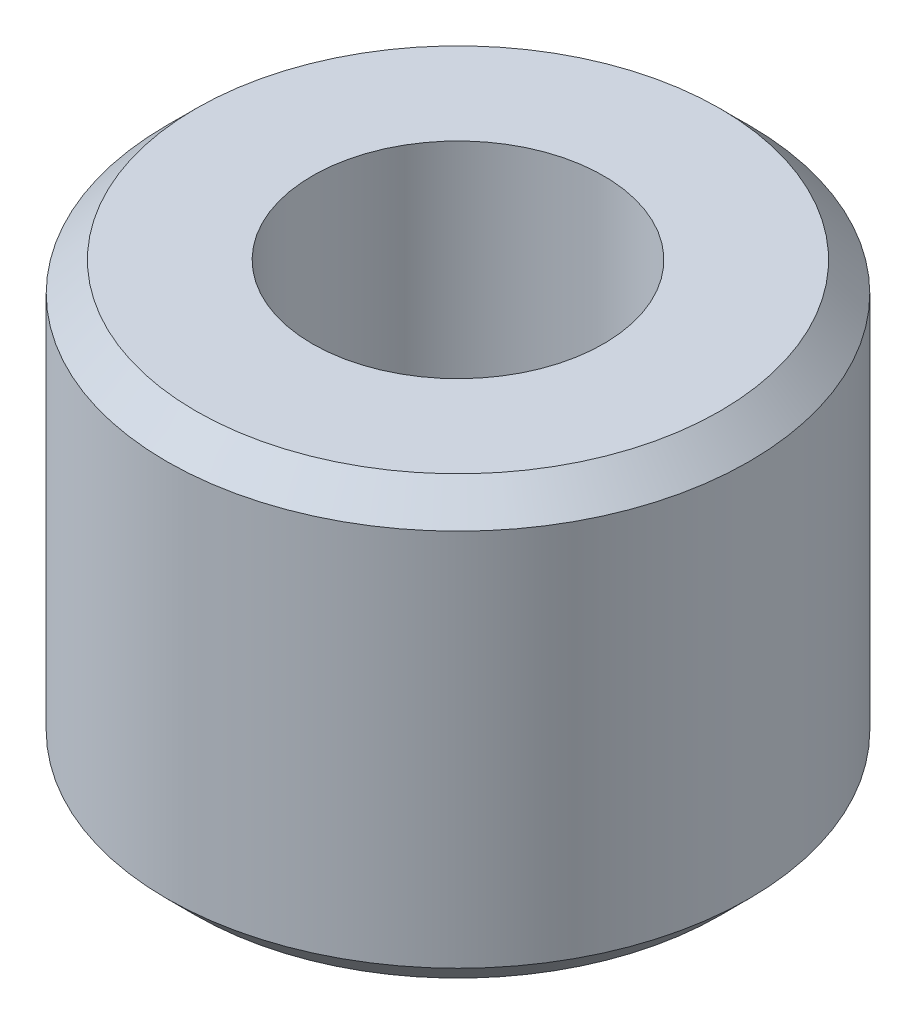
ISO-10303-21;
HEADER;
FILE_DESCRIPTION(('STEP AP214'),'2;1');
FILE_NAME('part.step','',(''),(''),'','','');
FILE_SCHEMA(('AUTOMOTIVE_DESIGN { 1 0 10303 214 1 1 1 1 }'));
ENDSEC;
DATA;
#1=APPLICATION_CONTEXT('core data for automotive mechanical design processes');
#2=APPLICATION_PROTOCOL_DEFINITION('international standard','automotive_design',2000,#1);
#3=PRODUCT_CONTEXT('',#1,'mechanical');
#4=PRODUCT('Part','Part','',(#3));
#5=PRODUCT_RELATED_PRODUCT_CATEGORY('part','',(#4));
#6=PRODUCT_DEFINITION_FORMATION('','',#4);
#7=PRODUCT_DEFINITION_CONTEXT('part definition',#1,'design');
#8=PRODUCT_DEFINITION('design','',#6,#7);
#9=PRODUCT_DEFINITION_SHAPE('','',#8);
#10=(LENGTH_UNIT() NAMED_UNIT(*) SI_UNIT(.MILLI.,.METRE.));
#11=(NAMED_UNIT(*) PLANE_ANGLE_UNIT() SI_UNIT($,.RADIAN.));
#12=(NAMED_UNIT(*) SI_UNIT($,.STERADIAN.) SOLID_ANGLE_UNIT());
#13=UNCERTAINTY_MEASURE_WITH_UNIT(LENGTH_MEASURE(1.E-05),#10,'distance_accuracy_value','');
#14=(GEOMETRIC_REPRESENTATION_CONTEXT(3) GLOBAL_UNCERTAINTY_ASSIGNED_CONTEXT((#13)) GLOBAL_UNIT_ASSIGNED_CONTEXT((#10,
#11,#12)) REPRESENTATION_CONTEXT('',''));
#15=CARTESIAN_POINT('',(0.,0.,0.));
#16=DIRECTION('',(0.,0.,1.));
#17=DIRECTION('',(1.,0.,0.));
#18=AXIS2_PLACEMENT_3D('',#15,#16,#17);
#19=CARTESIAN_POINT('',(0.,15.,0.));
#20=DIRECTION('',(0.,1.,0.));
#21=DIRECTION('',(0.,0.,1.));
#22=AXIS2_PLACEMENT_3D('',#19,#20,#21);
#23=PLANE('',#22);
#24=CARTESIAN_POINT('',(0.,15.,0.));
#25=DIRECTION('',(0.,1.,0.));
#26=DIRECTION('',(0.,0.,1.));
#27=AXIS2_PLACEMENT_3D('',#24,#25,#26);
#28=CIRCLE('',#27,9.00000000000001);
#29=CARTESIAN_POINT('',(0.,15.,9.00000000000001));
#30=VERTEX_POINT('',#29);
#31=EDGE_CURVE('E10',#30,#30,#28,.T.);
#32=ORIENTED_EDGE('',*,*,#31,.T.);
#33=EDGE_LOOP('',(#32));
#34=FACE_BOUND('',#33,.T.);
#35=CARTESIAN_POINT('',(0.,15.,0.));
#36=DIRECTION('',(0.,1.,0.));
#37=DIRECTION('',(0.,0.,1.));
#38=AXIS2_PLACEMENT_3D('',#35,#36,#37);
#39=CIRCLE('',#38,5.);
#40=CARTESIAN_POINT('',(0.,15.,5.));
#41=VERTEX_POINT('',#40);
#42=EDGE_CURVE('E64',#41,#41,#39,.T.);
#43=ORIENTED_EDGE('',*,*,#42,.F.);
#44=EDGE_LOOP('',(#43));
#45=FACE_BOUND('',#44,.T.);
#46=ADVANCED_FACE('F39',(#34,#45),#23,.T.);
#47=CARTESIAN_POINT('',(0.,0.,0.));
#48=DIRECTION('',(0.,1.,0.));
#49=DIRECTION('',(0.,0.,1.));
#50=AXIS2_PLACEMENT_3D('',#47,#48,#49);
#51=PLANE('',#50);
#52=CARTESIAN_POINT('',(0.,0.,0.));
#53=DIRECTION('',(0.,1.,0.));
#54=DIRECTION('',(0.,0.,1.));
#55=AXIS2_PLACEMENT_3D('',#52,#53,#54);
#56=CIRCLE('',#55,8.99999999999999);
#57=CARTESIAN_POINT('',(0.,0.,8.99999999999999));
#58=VERTEX_POINT('',#57);
#59=EDGE_CURVE('E48',#58,#58,#56,.F.);
#60=ORIENTED_EDGE('',*,*,#59,.T.);
#61=EDGE_LOOP('',(#60));
#62=FACE_BOUND('',#61,.T.);
#63=CARTESIAN_POINT('',(0.,0.,0.));
#64=DIRECTION('',(0.,1.,0.));
#65=DIRECTION('',(0.,0.,1.));
#66=AXIS2_PLACEMENT_3D('',#63,#64,#65);
#67=CIRCLE('',#66,5.);
#68=CARTESIAN_POINT('',(0.,0.,5.));
#69=VERTEX_POINT('',#68);
#70=EDGE_CURVE('E65',#69,#69,#67,.T.);
#71=ORIENTED_EDGE('',*,*,#70,.T.);
#72=EDGE_LOOP('',(#71));
#73=FACE_BOUND('',#72,.T.);
#74=ADVANCED_FACE('F77',(#62,#73),#51,.F.);
#75=CARTESIAN_POINT('',(0.,15.,0.));
#76=DIRECTION('',(0.,-1.,0.));
#77=DIRECTION('',(0.,0.,-1.));
#78=AXIS2_PLACEMENT_3D('',#75,#76,#77);
#79=CYLINDRICAL_SURFACE('',#78,10.);
#80=CARTESIAN_POINT('',(0.,1.,0.));
#81=DIRECTION('',(0.,1.,0.));
#82=DIRECTION('',(0.,0.,1.));
#83=AXIS2_PLACEMENT_3D('',#80,#81,#82);
#84=CIRCLE('',#83,10.);
#85=CARTESIAN_POINT('',(0.,1.,10.));
#86=VERTEX_POINT('',#85);
#87=EDGE_CURVE('E53',#86,#86,#84,.T.);
#88=ORIENTED_EDGE('',*,*,#87,.T.);
#89=EDGE_LOOP('',(#88));
#90=FACE_BOUND('',#89,.T.);
#91=CARTESIAN_POINT('',(0.,14.,0.));
#92=DIRECTION('',(0.,1.,0.));
#93=DIRECTION('',(0.,0.,1.));
#94=AXIS2_PLACEMENT_3D('',#91,#92,#93);
#95=CIRCLE('',#94,10.);
#96=CARTESIAN_POINT('',(0.,14.,10.));
#97=VERTEX_POINT('',#96);
#98=EDGE_CURVE('E58',#97,#97,#95,.F.);
#99=ORIENTED_EDGE('',*,*,#98,.T.);
#100=EDGE_LOOP('',(#99));
#101=FACE_BOUND('',#100,.T.);
#102=ADVANCED_FACE('F82',(#90,#101),#79,.T.);
#103=CARTESIAN_POINT('',(0.,15.,0.));
#104=DIRECTION('',(0.,-1.,0.));
#105=DIRECTION('',(0.,0.,-1.));
#106=AXIS2_PLACEMENT_3D('',#103,#104,#105);
#107=CYLINDRICAL_SURFACE('',#106,5.);
#108=ORIENTED_EDGE('',*,*,#42,.T.);
#109=EDGE_LOOP('',(#108));
#110=FACE_BOUND('',#109,.T.);
#111=ORIENTED_EDGE('',*,*,#70,.F.);
#112=EDGE_LOOP('',(#111));
#113=FACE_BOUND('',#112,.T.);
#114=ADVANCED_FACE('F73',(#110,#113),#107,.F.);
#115=CARTESIAN_POINT('',(0.,1.,0.));
#116=DIRECTION('',(0.,1.,0.));
#117=DIRECTION('',(0.,0.,1.));
#118=AXIS2_PLACEMENT_3D('',#115,#116,#117);
#119=CONICAL_SURFACE('',#118,10.,0.785398163397452);
#120=ORIENTED_EDGE('',*,*,#59,.F.);
#121=EDGE_LOOP('',(#120));
#122=FACE_BOUND('',#121,.T.);
#123=ORIENTED_EDGE('',*,*,#87,.F.);
#124=EDGE_LOOP('',(#123));
#125=FACE_BOUND('',#124,.T.);
#126=ADVANCED_FACE('F89',(#122,#125),#119,.T.);
#127=CARTESIAN_POINT('',(0.,15.,0.));
#128=DIRECTION('',(0.,-1.,0.));
#129=DIRECTION('',(0.,0.,-1.));
#130=AXIS2_PLACEMENT_3D('',#127,#128,#129);
#131=CONICAL_SURFACE('',#130,9.00000000000001,0.785398163397447);
#132=ORIENTED_EDGE('',*,*,#98,.F.);
#133=EDGE_LOOP('',(#132));
#134=FACE_BOUND('',#133,.T.);
#135=ORIENTED_EDGE('',*,*,#31,.F.);
#136=EDGE_LOOP('',(#135));
#137=FACE_BOUND('',#136,.T.);
#138=ADVANCED_FACE('F42',(#134,#137),#131,.T.);
#139=CLOSED_SHELL('',(#46,#74,#102,#114,#126,#138));
#140=MANIFOLD_SOLID_BREP('B2',#139);
#141=ADVANCED_BREP_SHAPE_REPRESENTATION('',(#18,#140),#14);
#142=SHAPE_DEFINITION_REPRESENTATION(#9,#141);
ENDSEC;
END-ISO-10303-21;
